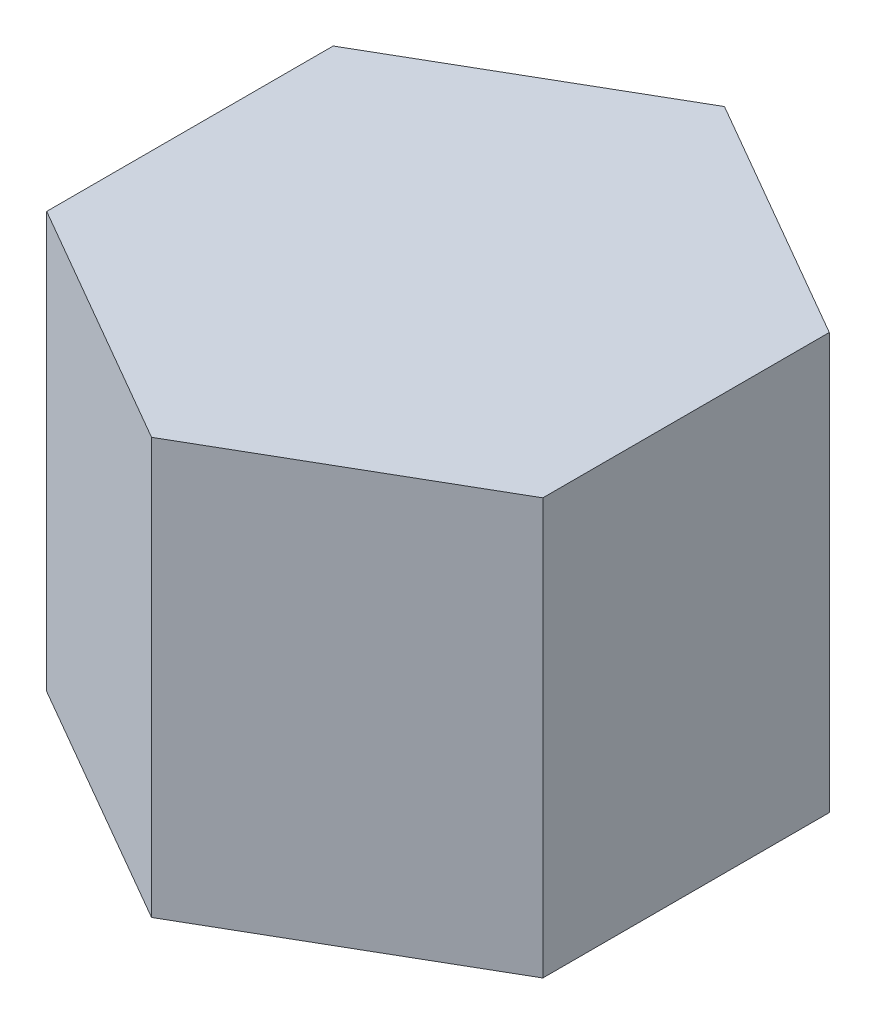
ISO-10303-21;
HEADER;
FILE_DESCRIPTION(('STEP AP214'),'2;1');
FILE_NAME('part.step','',(''),(''),'','','');
FILE_SCHEMA(('AUTOMOTIVE_DESIGN { 1 0 10303 214 1 1 1 1 }'));
ENDSEC;
DATA;
#1=APPLICATION_CONTEXT('core data for automotive mechanical design processes');
#2=APPLICATION_PROTOCOL_DEFINITION('international standard','automotive_design',2000,#1);
#3=PRODUCT_CONTEXT('',#1,'mechanical');
#4=PRODUCT('Part','Part','',(#3));
#5=PRODUCT_RELATED_PRODUCT_CATEGORY('part','',(#4));
#6=PRODUCT_DEFINITION_FORMATION('','',#4);
#7=PRODUCT_DEFINITION_CONTEXT('part definition',#1,'design');
#8=PRODUCT_DEFINITION('design','',#6,#7);
#9=PRODUCT_DEFINITION_SHAPE('','',#8);
#10=(LENGTH_UNIT() NAMED_UNIT(*) SI_UNIT(.MILLI.,.METRE.));
#11=(NAMED_UNIT(*) PLANE_ANGLE_UNIT() SI_UNIT($,.RADIAN.));
#12=(NAMED_UNIT(*) SI_UNIT($,.STERADIAN.) SOLID_ANGLE_UNIT());
#13=UNCERTAINTY_MEASURE_WITH_UNIT(LENGTH_MEASURE(1.E-05),#10,'distance_accuracy_value','');
#14=(GEOMETRIC_REPRESENTATION_CONTEXT(3) GLOBAL_UNCERTAINTY_ASSIGNED_CONTEXT((#13)) GLOBAL_UNIT_ASSIGNED_CONTEXT((#10,
#11,#12)) REPRESENTATION_CONTEXT('',''));
#15=CARTESIAN_POINT('',(0.,0.,0.));
#16=DIRECTION('',(0.,0.,1.));
#17=DIRECTION('',(1.,0.,0.));
#18=AXIS2_PLACEMENT_3D('',#15,#16,#17);
#19=CARTESIAN_POINT('',(207.642660308706,-148.537700895744,293.239022028063));
#20=DIRECTION('',(-0.499999999999909,0.,-0.866025403784491));
#21=DIRECTION('',(-0.866025403784491,0.,0.499999999999909));
#22=AXIS2_PLACEMENT_3D('',#19,#20,#21);
#23=PLANE('',#22);
#24=CARTESIAN_POINT('',(207.339551417382,-149.045793579175,293.414022028063));
#25=DIRECTION('',(0.866025403784491,0.,-0.499999999999909));
#26=VECTOR('',#25,1.);
#27=LINE('',#24,#26);
#28=CARTESIAN_POINT('',(207.339551417382,-149.045793579175,293.414022028063));
#29=VERTEX_POINT('',#28);
#30=CARTESIAN_POINT('',(207.642660308706,-149.045793579175,293.239022028063));
#31=VERTEX_POINT('',#30);
#32=EDGE_CURVE('E170',#29,#31,#27,.T.);
#33=ORIENTED_EDGE('',*,*,#32,.T.);
#34=CARTESIAN_POINT('',(207.642660308706,-148.537700895744,293.239022028063));
#35=DIRECTION('',(0.,-1.,0.));
#36=VECTOR('',#35,1.);
#37=LINE('',#34,#36);
#38=CARTESIAN_POINT('',(207.642660308706,-148.537700895744,293.239022028063));
#39=VERTEX_POINT('',#38);
#40=EDGE_CURVE('E35',#39,#31,#37,.T.);
#41=ORIENTED_EDGE('',*,*,#40,.F.);
#42=CARTESIAN_POINT('',(207.339551417382,-148.537700895744,293.414022028063));
#43=DIRECTION('',(0.866025403784491,0.,-0.499999999999909));
#44=VECTOR('',#43,1.);
#45=LINE('',#42,#44);
#46=CARTESIAN_POINT('',(207.339551417382,-148.537700895744,293.414022028063));
#47=VERTEX_POINT('',#46);
#48=EDGE_CURVE('E159',#47,#39,#45,.T.);
#49=ORIENTED_EDGE('',*,*,#48,.F.);
#50=CARTESIAN_POINT('',(207.339551417382,-148.537700895744,293.414022028063));
#51=DIRECTION('',(0.,-1.,0.));
#52=VECTOR('',#51,1.);
#53=LINE('',#50,#52);
#54=EDGE_CURVE('E10',#47,#29,#53,.T.);
#55=ORIENTED_EDGE('',*,*,#54,.T.);
#56=EDGE_LOOP('',(#33,#41,#49,#55));
#57=FACE_BOUND('',#56,.T.);
#58=ADVANCED_FACE('F16',(#57),#23,.F.);
#59=CARTESIAN_POINT('',(207.339551417382,-148.537700895744,293.414022028063));
#60=DIRECTION('',(0.500000000000062,0.,-0.866025403784403));
#61=DIRECTION('',(-0.866025403784403,0.,-0.500000000000062));
#62=AXIS2_PLACEMENT_3D('',#59,#60,#61);
#63=PLANE('',#62);
#64=CARTESIAN_POINT('',(207.036442526057,-149.045793579175,293.239022028063));
#65=DIRECTION('',(0.866025403784403,0.,0.500000000000062));
#66=VECTOR('',#65,1.);
#67=LINE('',#64,#66);
#68=CARTESIAN_POINT('',(207.036442526057,-149.045793579175,293.239022028063));
#69=VERTEX_POINT('',#68);
#70=EDGE_CURVE('E167',#69,#29,#67,.T.);
#71=ORIENTED_EDGE('',*,*,#70,.T.);
#72=ORIENTED_EDGE('',*,*,#54,.F.);
#73=CARTESIAN_POINT('',(207.036442526057,-148.537700895744,293.239022028063));
#74=DIRECTION('',(0.866025403784403,0.,0.500000000000062));
#75=VECTOR('',#74,1.);
#76=LINE('',#73,#75);
#77=CARTESIAN_POINT('',(207.036442526057,-148.537700895744,293.239022028063));
#78=VERTEX_POINT('',#77);
#79=EDGE_CURVE('E156',#78,#47,#76,.T.);
#80=ORIENTED_EDGE('',*,*,#79,.F.);
#81=CARTESIAN_POINT('',(207.036442526057,-148.537700895744,293.239022028063));
#82=DIRECTION('',(0.,-1.,0.));
#83=VECTOR('',#82,1.);
#84=LINE('',#81,#83);
#85=EDGE_CURVE('E27',#78,#69,#84,.T.);
#86=ORIENTED_EDGE('',*,*,#85,.T.);
#87=EDGE_LOOP('',(#71,#72,#80,#86));
#88=FACE_BOUND('',#87,.T.);
#89=ADVANCED_FACE('F189',(#88),#63,.F.);
#90=CARTESIAN_POINT('',(207.036442526057,-148.537700895744,290.831971220494));
#91=DIRECTION('',(1.,0.,0.));
#92=DIRECTION('',(0.,1.,0.));
#93=AXIS2_PLACEMENT_3D('',#90,#91,#92);
#94=PLANE('',#93);
#95=CARTESIAN_POINT('',(207.036442526057,-149.045793579175,292.889022028063));
#96=DIRECTION('',(0.,0.,1.));
#97=VECTOR('',#96,1.);
#98=LINE('',#95,#97);
#99=CARTESIAN_POINT('',(207.036442526057,-149.045793579175,292.889022028063));
#100=VERTEX_POINT('',#99);
#101=EDGE_CURVE('E163',#100,#69,#98,.T.);
#102=ORIENTED_EDGE('',*,*,#101,.T.);
#103=ORIENTED_EDGE('',*,*,#85,.F.);
#104=CARTESIAN_POINT('',(207.036442526057,-148.537700895744,292.889022028063));
#105=DIRECTION('',(0.,0.,1.));
#106=VECTOR('',#105,1.);
#107=LINE('',#104,#106);
#108=CARTESIAN_POINT('',(207.036442526057,-148.537700895744,292.889022028063));
#109=VERTEX_POINT('',#108);
#110=EDGE_CURVE('E106',#109,#78,#107,.T.);
#111=ORIENTED_EDGE('',*,*,#110,.F.);
#112=CARTESIAN_POINT('',(207.036442526057,-148.537700895744,292.889022028063));
#113=DIRECTION('',(0.,-1.,0.));
#114=VECTOR('',#113,1.);
#115=LINE('',#112,#114);
#116=EDGE_CURVE('E94',#109,#100,#115,.T.);
#117=ORIENTED_EDGE('',*,*,#116,.T.);
#118=EDGE_LOOP('',(#102,#103,#111,#117));
#119=FACE_BOUND('',#118,.T.);
#120=ADVANCED_FACE('F198',(#119),#94,.F.);
#121=CARTESIAN_POINT('',(207.036442526057,-148.537700895744,292.889022028063));
#122=DIRECTION('',(0.499999999999943,0.,0.866025403784472));
#123=DIRECTION('',(0.866025403784472,0.,-0.499999999999943));
#124=AXIS2_PLACEMENT_3D('',#121,#122,#123);
#125=PLANE('',#124);
#126=CARTESIAN_POINT('',(207.339551417382,-149.045793579175,292.714022028063));
#127=DIRECTION('',(-0.866025403784471,0.,0.499999999999943));
#128=VECTOR('',#127,1.);
#129=LINE('',#126,#128);
#130=CARTESIAN_POINT('',(207.339551417382,-149.045793579175,292.714022028063));
#131=VERTEX_POINT('',#130);
#132=EDGE_CURVE('E162',#131,#100,#129,.T.);
#133=ORIENTED_EDGE('',*,*,#132,.T.);
#134=ORIENTED_EDGE('',*,*,#116,.F.);
#135=CARTESIAN_POINT('',(207.339551417382,-148.537700895744,292.714022028063));
#136=DIRECTION('',(-0.866025403784471,0.,0.499999999999943));
#137=VECTOR('',#136,1.);
#138=LINE('',#135,#137);
#139=CARTESIAN_POINT('',(207.339551417382,-148.537700895744,292.714022028063));
#140=VERTEX_POINT('',#139);
#141=EDGE_CURVE('E98',#140,#109,#138,.T.);
#142=ORIENTED_EDGE('',*,*,#141,.F.);
#143=CARTESIAN_POINT('',(207.339551417382,-148.537700895744,292.714022028063));
#144=DIRECTION('',(0.,-1.,0.));
#145=VECTOR('',#144,1.);
#146=LINE('',#143,#145);
#147=EDGE_CURVE('E79',#140,#131,#146,.T.);
#148=ORIENTED_EDGE('',*,*,#147,.T.);
#149=EDGE_LOOP('',(#133,#134,#142,#148));
#150=FACE_BOUND('',#149,.T.);
#151=ADVANCED_FACE('F100',(#150),#125,.F.);
#152=CARTESIAN_POINT('',(207.339551417382,-148.537700895744,292.714022028063));
#153=DIRECTION('',(-0.500000000000062,0.,0.866025403784403));
#154=DIRECTION('',(0.866025403784403,0.,0.500000000000062));
#155=AXIS2_PLACEMENT_3D('',#152,#153,#154);
#156=PLANE('',#155);
#157=CARTESIAN_POINT('',(207.642660308706,-149.045793579175,292.889022028063));
#158=DIRECTION('',(-0.866025403784403,0.,-0.500000000000062));
#159=VECTOR('',#158,1.);
#160=LINE('',#157,#159);
#161=CARTESIAN_POINT('',(207.642660308706,-149.045793579175,292.889022028063));
#162=VERTEX_POINT('',#161);
#163=EDGE_CURVE('E88',#162,#131,#160,.T.);
#164=ORIENTED_EDGE('',*,*,#163,.T.);
#165=ORIENTED_EDGE('',*,*,#147,.F.);
#166=CARTESIAN_POINT('',(207.642660308706,-148.537700895744,292.889022028063));
#167=DIRECTION('',(-0.866025403784403,0.,-0.500000000000062));
#168=VECTOR('',#167,1.);
#169=LINE('',#166,#168);
#170=CARTESIAN_POINT('',(207.642660308706,-148.537700895744,292.889022028063));
#171=VERTEX_POINT('',#170);
#172=EDGE_CURVE('E84',#171,#140,#169,.T.);
#173=ORIENTED_EDGE('',*,*,#172,.F.);
#174=CARTESIAN_POINT('',(207.642660308706,-148.537700895744,292.889022028063));
#175=DIRECTION('',(0.,-1.,0.));
#176=VECTOR('',#175,1.);
#177=LINE('',#174,#176);
#178=EDGE_CURVE('E58',#171,#162,#177,.T.);
#179=ORIENTED_EDGE('',*,*,#178,.T.);
#180=EDGE_LOOP('',(#164,#165,#173,#179));
#181=FACE_BOUND('',#180,.T.);
#182=ADVANCED_FACE('F82',(#181),#156,.F.);
#183=CARTESIAN_POINT('',(207.642660308706,-148.537700895744,290.831971220494));
#184=DIRECTION('',(-1.,0.,0.));
#185=DIRECTION('',(0.,-1.,0.));
#186=AXIS2_PLACEMENT_3D('',#183,#184,#185);
#187=PLANE('',#186);
#188=CARTESIAN_POINT('',(207.642660308706,-149.045793579175,293.239022028063));
#189=DIRECTION('',(0.,0.,-1.));
#190=VECTOR('',#189,1.);
#191=LINE('',#188,#190);
#192=EDGE_CURVE('E160',#31,#162,#191,.T.);
#193=ORIENTED_EDGE('',*,*,#192,.T.);
#194=ORIENTED_EDGE('',*,*,#178,.F.);
#195=CARTESIAN_POINT('',(207.642660308706,-148.537700895744,293.239022028063));
#196=DIRECTION('',(0.,0.,-1.));
#197=VECTOR('',#196,1.);
#198=LINE('',#195,#197);
#199=EDGE_CURVE('E112',#39,#171,#198,.T.);
#200=ORIENTED_EDGE('',*,*,#199,.F.);
#201=ORIENTED_EDGE('',*,*,#40,.T.);
#202=EDGE_LOOP('',(#193,#194,#200,#201));
#203=FACE_BOUND('',#202,.T.);
#204=ADVANCED_FACE('F131',(#203),#187,.F.);
#205=CARTESIAN_POINT('',(206.339551417382,-148.537700895744,290.831971220494));
#206=DIRECTION('',(0.,-1.,0.));
#207=DIRECTION('',(1.,0.,0.));
#208=AXIS2_PLACEMENT_3D('',#205,#206,#207);
#209=PLANE('',#208);
#210=ORIENTED_EDGE('',*,*,#48,.T.);
#211=ORIENTED_EDGE('',*,*,#199,.T.);
#212=ORIENTED_EDGE('',*,*,#172,.T.);
#213=ORIENTED_EDGE('',*,*,#141,.T.);
#214=ORIENTED_EDGE('',*,*,#110,.T.);
#215=ORIENTED_EDGE('',*,*,#79,.T.);
#216=EDGE_LOOP('',(#210,#211,#212,#213,#214,#215));
#217=FACE_BOUND('',#216,.T.);
#218=ADVANCED_FACE('F111',(#217),#209,.F.);
#219=CARTESIAN_POINT('',(206.339551417382,-149.045793579175,290.831971220494));
#220=DIRECTION('',(0.,-1.,0.));
#221=DIRECTION('',(1.,0.,0.));
#222=AXIS2_PLACEMENT_3D('',#219,#220,#221);
#223=PLANE('',#222);
#224=ORIENTED_EDGE('',*,*,#32,.F.);
#225=ORIENTED_EDGE('',*,*,#70,.F.);
#226=ORIENTED_EDGE('',*,*,#101,.F.);
#227=ORIENTED_EDGE('',*,*,#132,.F.);
#228=ORIENTED_EDGE('',*,*,#163,.F.);
#229=ORIENTED_EDGE('',*,*,#192,.F.);
#230=EDGE_LOOP('',(#224,#225,#226,#227,#228,#229));
#231=FACE_BOUND('',#230,.T.);
#232=ADVANCED_FACE('F130',(#231),#223,.T.);
#233=CLOSED_SHELL('',(#58,#89,#120,#151,#182,#204,#218,#232));
#234=MANIFOLD_SOLID_BREP('B1',#233);
#235=ADVANCED_BREP_SHAPE_REPRESENTATION('',(#18,#234),#14);
#236=SHAPE_DEFINITION_REPRESENTATION(#9,#235);
ENDSEC;
END-ISO-10303-21;
